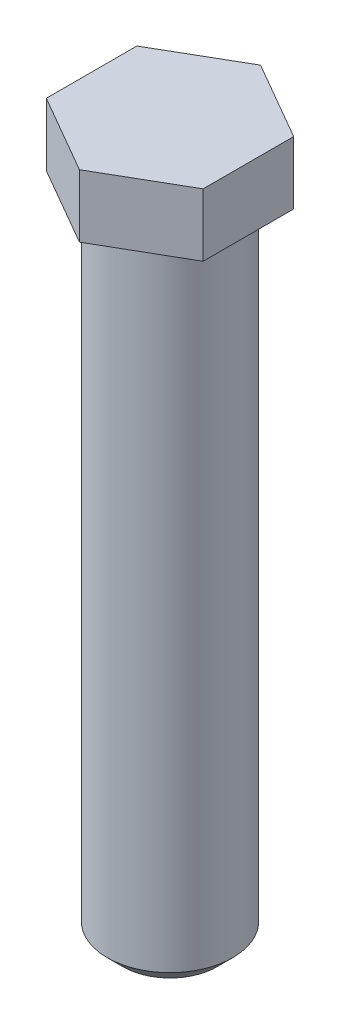
ISO-10303-21;
HEADER;
FILE_DESCRIPTION(('STEP AP214'),'2;1');
FILE_NAME('part.step','',(''),(''),'','','');
FILE_SCHEMA(('AUTOMOTIVE_DESIGN { 1 0 10303 214 1 1 1 1 }'));
ENDSEC;
DATA;
#1=APPLICATION_CONTEXT('core data for automotive mechanical design processes');
#2=APPLICATION_PROTOCOL_DEFINITION('international standard','automotive_design',2000,#1);
#3=PRODUCT_CONTEXT('',#1,'mechanical');
#4=PRODUCT('Part','Part','',(#3));
#5=PRODUCT_RELATED_PRODUCT_CATEGORY('part','',(#4));
#6=PRODUCT_DEFINITION_FORMATION('','',#4);
#7=PRODUCT_DEFINITION_CONTEXT('part definition',#1,'design');
#8=PRODUCT_DEFINITION('design','',#6,#7);
#9=PRODUCT_DEFINITION_SHAPE('','',#8);
#10=(LENGTH_UNIT() NAMED_UNIT(*) SI_UNIT(.MILLI.,.METRE.));
#11=(NAMED_UNIT(*) PLANE_ANGLE_UNIT() SI_UNIT($,.RADIAN.));
#12=(NAMED_UNIT(*) SI_UNIT($,.STERADIAN.) SOLID_ANGLE_UNIT());
#13=UNCERTAINTY_MEASURE_WITH_UNIT(LENGTH_MEASURE(1.E-05),#10,'distance_accuracy_value','');
#14=(GEOMETRIC_REPRESENTATION_CONTEXT(3) GLOBAL_UNCERTAINTY_ASSIGNED_CONTEXT((#13)) GLOBAL_UNIT_ASSIGNED_CONTEXT((#10,
#11,#12)) REPRESENTATION_CONTEXT('',''));
#15=CARTESIAN_POINT('',(0.,0.,0.));
#16=DIRECTION('',(0.,0.,1.));
#17=DIRECTION('',(1.,0.,0.));
#18=AXIS2_PLACEMENT_3D('',#15,#16,#17);
#19=CARTESIAN_POINT('',(0.,20.7,0.));
#20=DIRECTION('',(0.,-1.,0.));
#21=DIRECTION('',(0.,0.,-1.));
#22=AXIS2_PLACEMENT_3D('',#19,#20,#21);
#23=CYLINDRICAL_SURFACE('',#22,2.);
#24=CARTESIAN_POINT('',(0.,20.5,0.));
#25=DIRECTION('',(0.,1.,0.));
#26=DIRECTION('',(0.,0.,1.));
#27=AXIS2_PLACEMENT_3D('',#24,#25,#26);
#28=CIRCLE('',#27,2.);
#29=CARTESIAN_POINT('',(0.,20.5,2.));
#30=VERTEX_POINT('',#29);
#31=EDGE_CURVE('E11',#30,#30,#28,.F.);
#32=ORIENTED_EDGE('',*,*,#31,.T.);
#33=EDGE_LOOP('',(#32));
#34=FACE_BOUND('',#33,.T.);
#35=CARTESIAN_POINT('',(0.,0.499999999999997,0.));
#36=DIRECTION('',(0.,1.,0.));
#37=DIRECTION('',(0.,0.,1.));
#38=AXIS2_PLACEMENT_3D('',#35,#36,#37);
#39=CIRCLE('',#38,2.);
#40=CARTESIAN_POINT('',(0.,0.499999999999997,2.));
#41=VERTEX_POINT('',#40);
#42=EDGE_CURVE('E140',#41,#41,#39,.T.);
#43=ORIENTED_EDGE('',*,*,#42,.T.);
#44=EDGE_LOOP('',(#43));
#45=FACE_BOUND('',#44,.T.);
#46=ADVANCED_FACE('F35',(#34,#45),#23,.T.);
#47=CARTESIAN_POINT('',(0.,0.,0.));
#48=DIRECTION('',(0.,1.,0.));
#49=DIRECTION('',(0.,0.,1.));
#50=AXIS2_PLACEMENT_3D('',#47,#48,#49);
#51=PLANE('',#50);
#52=CARTESIAN_POINT('',(0.,0.,0.));
#53=DIRECTION('',(0.,1.,0.));
#54=DIRECTION('',(0.,0.,1.));
#55=AXIS2_PLACEMENT_3D('',#52,#53,#54);
#56=CIRCLE('',#55,1.5);
#57=CARTESIAN_POINT('',(0.,0.,1.5));
#58=VERTEX_POINT('',#57);
#59=EDGE_CURVE('E143',#58,#58,#56,.F.);
#60=ORIENTED_EDGE('',*,*,#59,.T.);
#61=EDGE_LOOP('',(#60));
#62=FACE_BOUND('',#61,.T.);
#63=ADVANCED_FACE('F160',(#62),#51,.F.);
#64=CARTESIAN_POINT('',(2.5,22.7,-1.44337567297407));
#65=DIRECTION('',(-0.5,0.,0.866025403784439));
#66=DIRECTION('',(0.866025403784439,0.,0.5));
#67=AXIS2_PLACEMENT_3D('',#64,#65,#66);
#68=PLANE('',#67);
#69=DIRECTION('',(-0.866025403784439,0.,-0.5));
#70=VECTOR('',#69,1.);
#71=CARTESIAN_POINT('',(2.5,20.7,-1.44337567297407));
#72=LINE('',#71,#70);
#73=CARTESIAN_POINT('',(2.5,20.7,-1.44337567297407));
#74=VERTEX_POINT('',#73);
#75=CARTESIAN_POINT('',(0.,20.7,-2.88675134594813));
#76=VERTEX_POINT('',#75);
#77=EDGE_CURVE('E121',#74,#76,#72,.T.);
#78=ORIENTED_EDGE('',*,*,#77,.T.);
#79=DIRECTION('',(0.,-1.,0.));
#80=VECTOR('',#79,1.);
#81=CARTESIAN_POINT('',(0.,22.7,-2.88675134594813));
#82=LINE('',#81,#80);
#83=CARTESIAN_POINT('',(0.,22.7,-2.88675134594813));
#84=VERTEX_POINT('',#83);
#85=EDGE_CURVE('E138',#84,#76,#82,.T.);
#86=ORIENTED_EDGE('',*,*,#85,.F.);
#87=DIRECTION('',(-0.866025403784439,0.,-0.5));
#88=VECTOR('',#87,1.);
#89=CARTESIAN_POINT('',(2.5,22.7,-1.44337567297407));
#90=LINE('',#89,#88);
#91=CARTESIAN_POINT('',(2.5,22.7,-1.44337567297407));
#92=VERTEX_POINT('',#91);
#93=EDGE_CURVE('E131',#92,#84,#90,.T.);
#94=ORIENTED_EDGE('',*,*,#93,.F.);
#95=DIRECTION('',(0.,-1.,0.));
#96=VECTOR('',#95,1.);
#97=CARTESIAN_POINT('',(2.5,22.7,-1.44337567297407));
#98=LINE('',#97,#96);
#99=EDGE_CURVE('E117',#92,#74,#98,.T.);
#100=ORIENTED_EDGE('',*,*,#99,.T.);
#101=EDGE_LOOP('',(#78,#86,#94,#100));
#102=FACE_BOUND('',#101,.T.);
#103=ADVANCED_FACE('F166',(#102),#68,.F.);
#104=CARTESIAN_POINT('',(0.,22.7,-2.88675134594813));
#105=DIRECTION('',(0.5,0.,0.866025403784438));
#106=DIRECTION('',(0.866025403784439,0.,-0.5));
#107=AXIS2_PLACEMENT_3D('',#104,#105,#106);
#108=PLANE('',#107);
#109=DIRECTION('',(-0.866025403784438,0.,0.5));
#110=VECTOR('',#109,1.);
#111=CARTESIAN_POINT('',(0.,20.7,-2.88675134594813));
#112=LINE('',#111,#110);
#113=CARTESIAN_POINT('',(-2.5,20.7,-1.44337567297406));
#114=VERTEX_POINT('',#113);
#115=EDGE_CURVE('E124',#76,#114,#112,.T.);
#116=ORIENTED_EDGE('',*,*,#115,.T.);
#117=DIRECTION('',(0.,-1.,0.));
#118=VECTOR('',#117,1.);
#119=CARTESIAN_POINT('',(-2.5,22.7,-1.44337567297406));
#120=LINE('',#119,#118);
#121=CARTESIAN_POINT('',(-2.5,22.7,-1.44337567297406));
#122=VERTEX_POINT('',#121);
#123=EDGE_CURVE('E135',#122,#114,#120,.T.);
#124=ORIENTED_EDGE('',*,*,#123,.F.);
#125=DIRECTION('',(-0.866025403784438,0.,0.5));
#126=VECTOR('',#125,1.);
#127=CARTESIAN_POINT('',(0.,22.7,-2.88675134594813));
#128=LINE('',#127,#126);
#129=EDGE_CURVE('E90',#84,#122,#128,.T.);
#130=ORIENTED_EDGE('',*,*,#129,.F.);
#131=ORIENTED_EDGE('',*,*,#85,.T.);
#132=EDGE_LOOP('',(#116,#124,#130,#131));
#133=FACE_BOUND('',#132,.T.);
#134=ADVANCED_FACE('F176',(#133),#108,.F.);
#135=CARTESIAN_POINT('',(-2.5,22.7,-1.44337567297406));
#136=DIRECTION('',(1.,0.,0.));
#137=DIRECTION('',(0.,0.,-1.));
#138=AXIS2_PLACEMENT_3D('',#135,#136,#137);
#139=PLANE('',#138);
#140=DIRECTION('',(0.,0.,1.));
#141=VECTOR('',#140,1.);
#142=CARTESIAN_POINT('',(-2.5,20.7,-1.44337567297406));
#143=LINE('',#142,#141);
#144=CARTESIAN_POINT('',(-2.5,20.7,1.44337567297407));
#145=VERTEX_POINT('',#144);
#146=EDGE_CURVE('E126',#114,#145,#143,.T.);
#147=ORIENTED_EDGE('',*,*,#146,.T.);
#148=DIRECTION('',(0.,-1.,0.));
#149=VECTOR('',#148,1.);
#150=CARTESIAN_POINT('',(-2.5,22.7,1.44337567297407));
#151=LINE('',#150,#149);
#152=CARTESIAN_POINT('',(-2.5,22.7,1.44337567297407));
#153=VERTEX_POINT('',#152);
#154=EDGE_CURVE('E112',#153,#145,#151,.T.);
#155=ORIENTED_EDGE('',*,*,#154,.F.);
#156=DIRECTION('',(0.,0.,1.));
#157=VECTOR('',#156,1.);
#158=CARTESIAN_POINT('',(-2.5,22.7,-1.44337567297406));
#159=LINE('',#158,#157);
#160=EDGE_CURVE('E103',#122,#153,#159,.T.);
#161=ORIENTED_EDGE('',*,*,#160,.F.);
#162=ORIENTED_EDGE('',*,*,#123,.T.);
#163=EDGE_LOOP('',(#147,#155,#161,#162));
#164=FACE_BOUND('',#163,.T.);
#165=ADVANCED_FACE('F180',(#164),#139,.F.);
#166=CARTESIAN_POINT('',(-2.5,22.7,1.44337567297407));
#167=DIRECTION('',(0.5,0.,-0.866025403784439));
#168=DIRECTION('',(-0.866025403784439,0.,-0.5));
#169=AXIS2_PLACEMENT_3D('',#166,#167,#168);
#170=PLANE('',#169);
#171=DIRECTION('',(0.866025403784439,0.,0.5));
#172=VECTOR('',#171,1.);
#173=CARTESIAN_POINT('',(-2.5,20.7,1.44337567297407));
#174=LINE('',#173,#172);
#175=CARTESIAN_POINT('',(0.,20.7,2.88675134594813));
#176=VERTEX_POINT('',#175);
#177=EDGE_CURVE('E111',#145,#176,#174,.T.);
#178=ORIENTED_EDGE('',*,*,#177,.T.);
#179=DIRECTION('',(0.,-1.,0.));
#180=VECTOR('',#179,1.);
#181=CARTESIAN_POINT('',(0.,22.7,2.88675134594813));
#182=LINE('',#181,#180);
#183=CARTESIAN_POINT('',(0.,22.7,2.88675134594813));
#184=VERTEX_POINT('',#183);
#185=EDGE_CURVE('E108',#184,#176,#182,.T.);
#186=ORIENTED_EDGE('',*,*,#185,.F.);
#187=DIRECTION('',(0.866025403784439,0.,0.5));
#188=VECTOR('',#187,1.);
#189=CARTESIAN_POINT('',(-2.5,22.7,1.44337567297407));
#190=LINE('',#189,#188);
#191=EDGE_CURVE('E97',#153,#184,#190,.T.);
#192=ORIENTED_EDGE('',*,*,#191,.F.);
#193=ORIENTED_EDGE('',*,*,#154,.T.);
#194=EDGE_LOOP('',(#178,#186,#192,#193));
#195=FACE_BOUND('',#194,.T.);
#196=ADVANCED_FACE('F109',(#195),#170,.F.);
#197=CARTESIAN_POINT('',(0.,22.7,2.88675134594813));
#198=DIRECTION('',(-0.5,0.,-0.866025403784439));
#199=DIRECTION('',(-0.866025403784439,0.,0.5));
#200=AXIS2_PLACEMENT_3D('',#197,#198,#199);
#201=PLANE('',#200);
#202=DIRECTION('',(0.866025403784439,0.,-0.5));
#203=VECTOR('',#202,1.);
#204=CARTESIAN_POINT('',(0.,20.7,2.88675134594813));
#205=LINE('',#204,#203);
#206=CARTESIAN_POINT('',(2.5,20.7,1.44337567297406));
#207=VERTEX_POINT('',#206);
#208=EDGE_CURVE('E75',#176,#207,#205,.T.);
#209=ORIENTED_EDGE('',*,*,#208,.T.);
#210=DIRECTION('',(0.,-1.,0.));
#211=VECTOR('',#210,1.);
#212=CARTESIAN_POINT('',(2.5,22.7,1.44337567297406));
#213=LINE('',#212,#211);
#214=CARTESIAN_POINT('',(2.5,22.7,1.44337567297406));
#215=VERTEX_POINT('',#214);
#216=EDGE_CURVE('E113',#215,#207,#213,.T.);
#217=ORIENTED_EDGE('',*,*,#216,.F.);
#218=DIRECTION('',(0.866025403784439,0.,-0.5));
#219=VECTOR('',#218,1.);
#220=CARTESIAN_POINT('',(0.,22.7,2.88675134594813));
#221=LINE('',#220,#219);
#222=EDGE_CURVE('E101',#184,#215,#221,.T.);
#223=ORIENTED_EDGE('',*,*,#222,.F.);
#224=ORIENTED_EDGE('',*,*,#185,.T.);
#225=EDGE_LOOP('',(#209,#217,#223,#224));
#226=FACE_BOUND('',#225,.T.);
#227=ADVANCED_FACE('F115',(#226),#201,.F.);
#228=CARTESIAN_POINT('',(2.5,22.7,1.44337567297406));
#229=DIRECTION('',(-1.,0.,0.));
#230=DIRECTION('',(0.,0.,1.));
#231=AXIS2_PLACEMENT_3D('',#228,#229,#230);
#232=PLANE('',#231);
#233=DIRECTION('',(0.,0.,-1.));
#234=VECTOR('',#233,1.);
#235=CARTESIAN_POINT('',(2.5,20.7,1.44337567297406));
#236=LINE('',#235,#234);
#237=EDGE_CURVE('E81',#207,#74,#236,.T.);
#238=ORIENTED_EDGE('',*,*,#237,.T.);
#239=ORIENTED_EDGE('',*,*,#99,.F.);
#240=DIRECTION('',(0.,0.,-1.));
#241=VECTOR('',#240,1.);
#242=CARTESIAN_POINT('',(2.5,22.7,1.44337567297406));
#243=LINE('',#242,#241);
#244=EDGE_CURVE('E52',#215,#92,#243,.T.);
#245=ORIENTED_EDGE('',*,*,#244,.F.);
#246=ORIENTED_EDGE('',*,*,#216,.T.);
#247=EDGE_LOOP('',(#238,#239,#245,#246));
#248=FACE_BOUND('',#247,.T.);
#249=ADVANCED_FACE('F188',(#248),#232,.F.);
#250=CARTESIAN_POINT('',(0.,22.7,0.));
#251=DIRECTION('',(0.,1.,0.));
#252=DIRECTION('',(0.,0.,1.));
#253=AXIS2_PLACEMENT_3D('',#250,#251,#252);
#254=PLANE('',#253);
#255=ORIENTED_EDGE('',*,*,#93,.T.);
#256=ORIENTED_EDGE('',*,*,#129,.T.);
#257=ORIENTED_EDGE('',*,*,#160,.T.);
#258=ORIENTED_EDGE('',*,*,#191,.T.);
#259=ORIENTED_EDGE('',*,*,#222,.T.);
#260=ORIENTED_EDGE('',*,*,#244,.T.);
#261=EDGE_LOOP('',(#255,#256,#257,#258,#259,#260));
#262=FACE_BOUND('',#261,.T.);
#263=ADVANCED_FACE('F99',(#262),#254,.T.);
#264=CARTESIAN_POINT('',(0.,20.7,0.));
#265=DIRECTION('',(0.,1.,0.));
#266=DIRECTION('',(0.,0.,1.));
#267=AXIS2_PLACEMENT_3D('',#264,#265,#266);
#268=PLANE('',#267);
#269=CARTESIAN_POINT('',(0.,20.7,0.));
#270=DIRECTION('',(0.,1.,0.));
#271=DIRECTION('',(0.,0.,1.));
#272=AXIS2_PLACEMENT_3D('',#269,#270,#271);
#273=CIRCLE('',#272,2.2);
#274=CARTESIAN_POINT('',(0.,20.7,2.2));
#275=VERTEX_POINT('',#274);
#276=EDGE_CURVE('E44',#275,#275,#273,.T.);
#277=ORIENTED_EDGE('',*,*,#276,.T.);
#278=EDGE_LOOP('',(#277));
#279=FACE_BOUND('',#278,.T.);
#280=ORIENTED_EDGE('',*,*,#77,.F.);
#281=ORIENTED_EDGE('',*,*,#237,.F.);
#282=ORIENTED_EDGE('',*,*,#208,.F.);
#283=ORIENTED_EDGE('',*,*,#177,.F.);
#284=ORIENTED_EDGE('',*,*,#146,.F.);
#285=ORIENTED_EDGE('',*,*,#115,.F.);
#286=EDGE_LOOP('',(#280,#281,#282,#283,#284,#285));
#287=FACE_BOUND('',#286,.T.);
#288=ADVANCED_FACE('F148',(#279,#287),#268,.F.);
#289=CARTESIAN_POINT('',(0.,0.499999999999997,0.));
#290=DIRECTION('',(0.,1.,0.));
#291=DIRECTION('',(0.,0.,1.));
#292=AXIS2_PLACEMENT_3D('',#289,#290,#291);
#293=CONICAL_SURFACE('',#292,2.,0.785398163397452);
#294=ORIENTED_EDGE('',*,*,#59,.F.);
#295=EDGE_LOOP('',(#294));
#296=FACE_BOUND('',#295,.T.);
#297=ORIENTED_EDGE('',*,*,#42,.F.);
#298=EDGE_LOOP('',(#297));
#299=FACE_BOUND('',#298,.T.);
#300=ADVANCED_FACE('F152',(#296,#299),#293,.T.);
#301=CARTESIAN_POINT('',(0.,20.5,0.));
#302=DIRECTION('',(0.,1.,0.));
#303=DIRECTION('',(0.,0.,1.));
#304=AXIS2_PLACEMENT_3D('',#301,#302,#303);
#305=TOROIDAL_SURFACE('',#304,2.2,0.2);
#306=ORIENTED_EDGE('',*,*,#31,.F.);
#307=EDGE_LOOP('',(#306));
#308=FACE_BOUND('',#307,.T.);
#309=ORIENTED_EDGE('',*,*,#276,.F.);
#310=EDGE_LOOP('',(#309));
#311=FACE_BOUND('',#310,.T.);
#312=ADVANCED_FACE('F37',(#308,#311),#305,.F.);
#313=CLOSED_SHELL('',(#46,#63,#103,#134,#165,#196,#227,#249,#263,#288,#300,#312));
#314=MANIFOLD_SOLID_BREP('B2',#313);
#315=ADVANCED_BREP_SHAPE_REPRESENTATION('',(#18,#314),#14);
#316=SHAPE_DEFINITION_REPRESENTATION(#9,#315);
ENDSEC;
END-ISO-10303-21;
